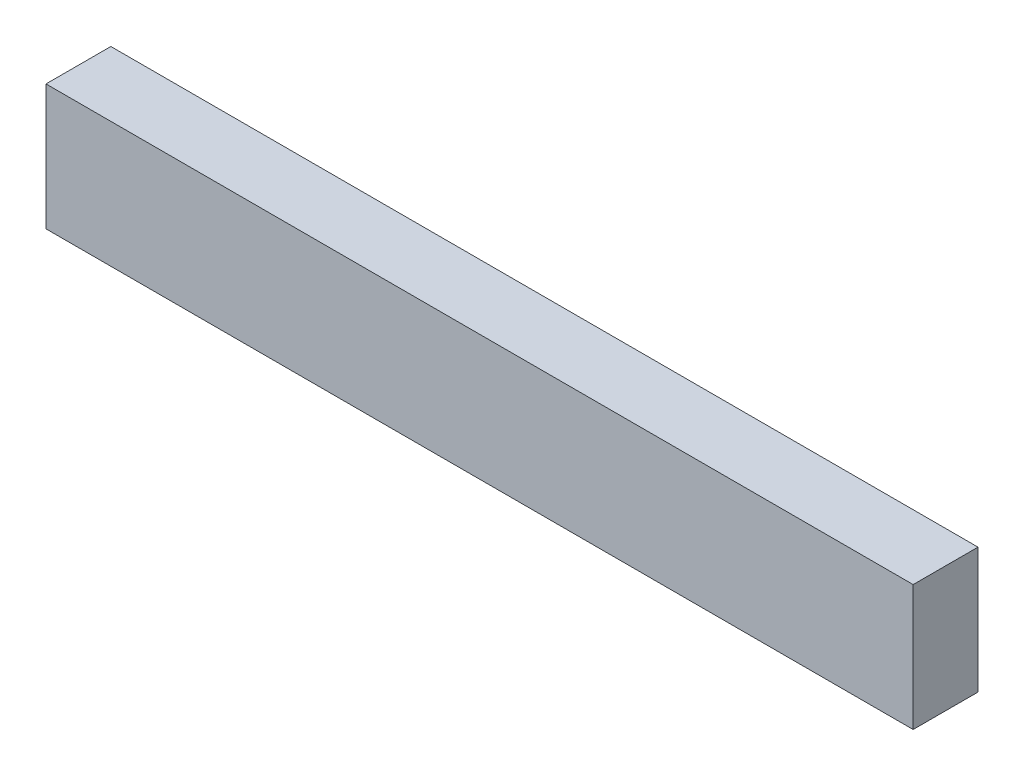
ISO-10303-21;
HEADER;
FILE_DESCRIPTION(('STEP AP214'),'2;1');
FILE_NAME('part.step','',(''),(''),'','','');
FILE_SCHEMA(('AUTOMOTIVE_DESIGN { 1 0 10303 214 1 1 1 1 }'));
ENDSEC;
DATA;
#1=APPLICATION_CONTEXT('core data for automotive mechanical design processes');
#2=APPLICATION_PROTOCOL_DEFINITION('international standard','automotive_design',2000,#1);
#3=PRODUCT_CONTEXT('',#1,'mechanical');
#4=PRODUCT('Part','Part','',(#3));
#5=PRODUCT_RELATED_PRODUCT_CATEGORY('part','',(#4));
#6=PRODUCT_DEFINITION_FORMATION('','',#4);
#7=PRODUCT_DEFINITION_CONTEXT('part definition',#1,'design');
#8=PRODUCT_DEFINITION('design','',#6,#7);
#9=PRODUCT_DEFINITION_SHAPE('','',#8);
#10=(LENGTH_UNIT() NAMED_UNIT(*) SI_UNIT(.MILLI.,.METRE.));
#11=(NAMED_UNIT(*) PLANE_ANGLE_UNIT() SI_UNIT($,.RADIAN.));
#12=(NAMED_UNIT(*) SI_UNIT($,.STERADIAN.) SOLID_ANGLE_UNIT());
#13=UNCERTAINTY_MEASURE_WITH_UNIT(LENGTH_MEASURE(1.E-05),#10,'distance_accuracy_value','');
#14=(GEOMETRIC_REPRESENTATION_CONTEXT(3) GLOBAL_UNCERTAINTY_ASSIGNED_CONTEXT((#13)) GLOBAL_UNIT_ASSIGNED_CONTEXT((#10,
#11,#12)) REPRESENTATION_CONTEXT('',''));
#15=CARTESIAN_POINT('',(0.,0.,0.));
#16=DIRECTION('',(0.,0.,1.));
#17=DIRECTION('',(1.,0.,0.));
#18=AXIS2_PLACEMENT_3D('',#15,#16,#17);
#19=CARTESIAN_POINT('',(21.2300000000001,246.236195285885,3.175));
#20=DIRECTION('',(-1.,0.,0.));
#21=DIRECTION('',(0.,0.,1.));
#22=AXIS2_PLACEMENT_3D('',#19,#20,#21);
#23=PLANE('',#22);
#24=DIRECTION('',(0.,1.,0.));
#25=VECTOR('',#24,1.);
#26=CARTESIAN_POINT('',(21.2300000000001,246.236195285885,0.));
#27=LINE('',#26,#25);
#28=CARTESIAN_POINT('',(21.2300000000001,246.236195285885,0.));
#29=VERTEX_POINT('',#28);
#30=CARTESIAN_POINT('',(21.2300000000001,252.382995285885,0.));
#31=VERTEX_POINT('',#30);
#32=EDGE_CURVE('E96',#29,#31,#27,.T.);
#33=ORIENTED_EDGE('',*,*,#32,.T.);
#34=DIRECTION('',(0.,0.,-1.));
#35=VECTOR('',#34,1.);
#36=CARTESIAN_POINT('',(21.2300000000001,252.382995285885,3.175));
#37=LINE('',#36,#35);
#38=CARTESIAN_POINT('',(21.2300000000001,252.382995285885,3.175));
#39=VERTEX_POINT('',#38);
#40=EDGE_CURVE('E11',#39,#31,#37,.T.);
#41=ORIENTED_EDGE('',*,*,#40,.F.);
#42=DIRECTION('',(0.,1.,0.));
#43=VECTOR('',#42,1.);
#44=CARTESIAN_POINT('',(21.2300000000001,246.236195285885,3.175));
#45=LINE('',#44,#43);
#46=CARTESIAN_POINT('',(21.2300000000001,246.236195285885,3.175));
#47=VERTEX_POINT('',#46);
#48=EDGE_CURVE('E84',#47,#39,#45,.T.);
#49=ORIENTED_EDGE('',*,*,#48,.F.);
#50=DIRECTION('',(0.,0.,-1.));
#51=VECTOR('',#50,1.);
#52=CARTESIAN_POINT('',(21.2300000000001,246.236195285885,3.175));
#53=LINE('',#52,#51);
#54=EDGE_CURVE('E92',#47,#29,#53,.T.);
#55=ORIENTED_EDGE('',*,*,#54,.T.);
#56=EDGE_LOOP('',(#33,#41,#49,#55));
#57=FACE_BOUND('',#56,.T.);
#58=ADVANCED_FACE('F33',(#57),#23,.F.);
#59=CARTESIAN_POINT('',(-21.2300000000001,252.382995285885,3.175));
#60=DIRECTION('',(0.,-1.,0.));
#61=DIRECTION('',(0.,0.,-1.));
#62=AXIS2_PLACEMENT_3D('',#59,#60,#61);
#63=PLANE('',#62);
#64=DIRECTION('',(-1.,0.,0.));
#65=VECTOR('',#64,1.);
#66=CARTESIAN_POINT('',(-21.2300000000001,252.382995285885,0.));
#67=LINE('',#66,#65);
#68=CARTESIAN_POINT('',(-21.2300000000001,252.382995285885,0.));
#69=VERTEX_POINT('',#68);
#70=EDGE_CURVE('E88',#31,#69,#67,.T.);
#71=ORIENTED_EDGE('',*,*,#70,.T.);
#72=DIRECTION('',(0.,0.,-1.));
#73=VECTOR('',#72,1.);
#74=CARTESIAN_POINT('',(-21.2300000000001,252.382995285885,3.175));
#75=LINE('',#74,#73);
#76=CARTESIAN_POINT('',(-21.2300000000001,252.382995285885,3.175));
#77=VERTEX_POINT('',#76);
#78=EDGE_CURVE('E41',#77,#69,#75,.T.);
#79=ORIENTED_EDGE('',*,*,#78,.F.);
#80=DIRECTION('',(-1.,0.,0.));
#81=VECTOR('',#80,1.);
#82=CARTESIAN_POINT('',(-21.2300000000001,252.382995285885,3.175));
#83=LINE('',#82,#81);
#84=EDGE_CURVE('E79',#39,#77,#83,.T.);
#85=ORIENTED_EDGE('',*,*,#84,.F.);
#86=ORIENTED_EDGE('',*,*,#40,.T.);
#87=EDGE_LOOP('',(#71,#79,#85,#86));
#88=FACE_BOUND('',#87,.T.);
#89=ADVANCED_FACE('F87',(#88),#63,.F.);
#90=CARTESIAN_POINT('',(-21.2300000000001,246.236195285885,3.175));
#91=DIRECTION('',(1.,0.,0.));
#92=DIRECTION('',(0.,0.,-1.));
#93=AXIS2_PLACEMENT_3D('',#90,#91,#92);
#94=PLANE('',#93);
#95=DIRECTION('',(0.,-1.,0.));
#96=VECTOR('',#95,1.);
#97=CARTESIAN_POINT('',(-21.2300000000001,246.236195285885,0.));
#98=LINE('',#97,#96);
#99=CARTESIAN_POINT('',(-21.2300000000001,246.236195285885,0.));
#100=VERTEX_POINT('',#99);
#101=EDGE_CURVE('E66',#69,#100,#98,.T.);
#102=ORIENTED_EDGE('',*,*,#101,.T.);
#103=DIRECTION('',(0.,0.,-1.));
#104=VECTOR('',#103,1.);
#105=CARTESIAN_POINT('',(-21.2300000000001,246.236195285885,3.175));
#106=LINE('',#105,#104);
#107=CARTESIAN_POINT('',(-21.2300000000001,246.236195285885,3.175));
#108=VERTEX_POINT('',#107);
#109=EDGE_CURVE('E89',#108,#100,#106,.T.);
#110=ORIENTED_EDGE('',*,*,#109,.F.);
#111=DIRECTION('',(0.,-1.,0.));
#112=VECTOR('',#111,1.);
#113=CARTESIAN_POINT('',(-21.2300000000001,246.236195285885,3.175));
#114=LINE('',#113,#112);
#115=EDGE_CURVE('E82',#77,#108,#114,.T.);
#116=ORIENTED_EDGE('',*,*,#115,.F.);
#117=ORIENTED_EDGE('',*,*,#78,.T.);
#118=EDGE_LOOP('',(#102,#110,#116,#117));
#119=FACE_BOUND('',#118,.T.);
#120=ADVANCED_FACE('F90',(#119),#94,.F.);
#121=CARTESIAN_POINT('',(-21.2300000000001,246.236195285885,3.175));
#122=DIRECTION('',(0.,1.,0.));
#123=DIRECTION('',(0.,0.,1.));
#124=AXIS2_PLACEMENT_3D('',#121,#122,#123);
#125=PLANE('',#124);
#126=DIRECTION('',(1.,0.,0.));
#127=VECTOR('',#126,1.);
#128=CARTESIAN_POINT('',(-21.2300000000001,246.236195285885,0.));
#129=LINE('',#128,#127);
#130=EDGE_CURVE('E72',#100,#29,#129,.T.);
#131=ORIENTED_EDGE('',*,*,#130,.T.);
#132=ORIENTED_EDGE('',*,*,#54,.F.);
#133=DIRECTION('',(1.,0.,0.));
#134=VECTOR('',#133,1.);
#135=CARTESIAN_POINT('',(-21.2300000000001,246.236195285885,3.175));
#136=LINE('',#135,#134);
#137=EDGE_CURVE('E49',#108,#47,#136,.T.);
#138=ORIENTED_EDGE('',*,*,#137,.F.);
#139=ORIENTED_EDGE('',*,*,#109,.T.);
#140=EDGE_LOOP('',(#131,#132,#138,#139));
#141=FACE_BOUND('',#140,.T.);
#142=ADVANCED_FACE('F103',(#141),#125,.F.);
#143=CARTESIAN_POINT('',(0.,0.,3.175));
#144=DIRECTION('',(0.,0.,-1.));
#145=DIRECTION('',(-1.,0.,0.));
#146=AXIS2_PLACEMENT_3D('',#143,#144,#145);
#147=PLANE('',#146);
#148=ORIENTED_EDGE('',*,*,#48,.T.);
#149=ORIENTED_EDGE('',*,*,#84,.T.);
#150=ORIENTED_EDGE('',*,*,#115,.T.);
#151=ORIENTED_EDGE('',*,*,#137,.T.);
#152=EDGE_LOOP('',(#148,#149,#150,#151));
#153=FACE_BOUND('',#152,.T.);
#154=ADVANCED_FACE('F80',(#153),#147,.F.);
#155=CARTESIAN_POINT('',(0.,0.,0.));
#156=DIRECTION('',(0.,0.,-1.));
#157=DIRECTION('',(-1.,0.,0.));
#158=AXIS2_PLACEMENT_3D('',#155,#156,#157);
#159=PLANE('',#158);
#160=ORIENTED_EDGE('',*,*,#32,.F.);
#161=ORIENTED_EDGE('',*,*,#130,.F.);
#162=ORIENTED_EDGE('',*,*,#101,.F.);
#163=ORIENTED_EDGE('',*,*,#70,.F.);
#164=EDGE_LOOP('',(#160,#161,#162,#163));
#165=FACE_BOUND('',#164,.T.);
#166=ADVANCED_FACE('F106',(#165),#159,.T.);
#167=CLOSED_SHELL('',(#58,#89,#120,#142,#154,#166));
#168=MANIFOLD_SOLID_BREP('B2',#167);
#169=ADVANCED_BREP_SHAPE_REPRESENTATION('',(#18,#168),#14);
#170=SHAPE_DEFINITION_REPRESENTATION(#9,#169);
ENDSEC;
END-ISO-10303-21;
